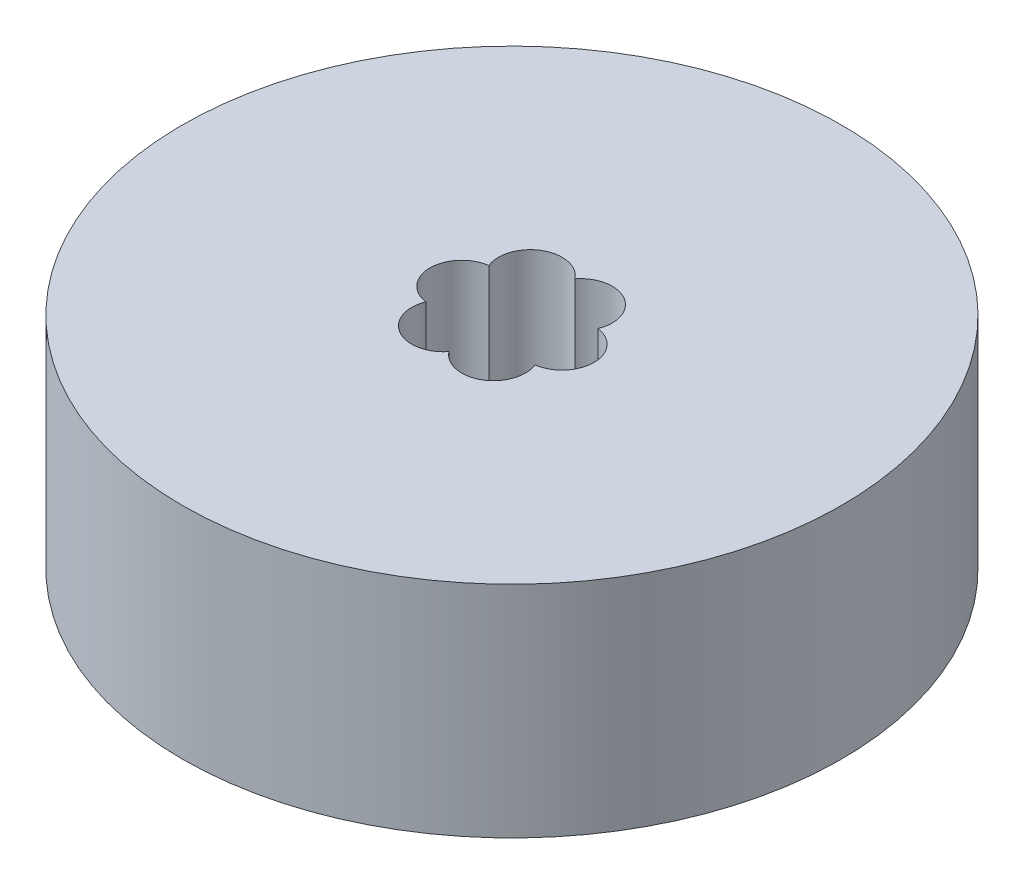
ISO-10303-21;
HEADER;
FILE_DESCRIPTION(('STEP AP214'),'2;1');
FILE_NAME('part.step','',(''),(''),'','','');
FILE_SCHEMA(('AUTOMOTIVE_DESIGN { 1 0 10303 214 1 1 1 1 }'));
ENDSEC;
DATA;
#1=APPLICATION_CONTEXT('core data for automotive mechanical design processes');
#2=APPLICATION_PROTOCOL_DEFINITION('international standard','automotive_design',2000,#1);
#3=PRODUCT_CONTEXT('',#1,'mechanical');
#4=PRODUCT('Part','Part','',(#3));
#5=PRODUCT_RELATED_PRODUCT_CATEGORY('part','',(#4));
#6=PRODUCT_DEFINITION_FORMATION('','',#4);
#7=PRODUCT_DEFINITION_CONTEXT('part definition',#1,'design');
#8=PRODUCT_DEFINITION('design','',#6,#7);
#9=PRODUCT_DEFINITION_SHAPE('','',#8);
#10=(LENGTH_UNIT() NAMED_UNIT(*) SI_UNIT(.MILLI.,.METRE.));
#11=(NAMED_UNIT(*) PLANE_ANGLE_UNIT() SI_UNIT($,.RADIAN.));
#12=(NAMED_UNIT(*) SI_UNIT($,.STERADIAN.) SOLID_ANGLE_UNIT());
#13=UNCERTAINTY_MEASURE_WITH_UNIT(LENGTH_MEASURE(1.E-05),#10,'distance_accuracy_value','');
#14=(GEOMETRIC_REPRESENTATION_CONTEXT(3) GLOBAL_UNCERTAINTY_ASSIGNED_CONTEXT((#13)) GLOBAL_UNIT_ASSIGNED_CONTEXT((#10,
#11,#12)) REPRESENTATION_CONTEXT('',''));
#15=CARTESIAN_POINT('',(0.,0.,0.));
#16=DIRECTION('',(0.,0.,1.));
#17=DIRECTION('',(1.,0.,0.));
#18=AXIS2_PLACEMENT_3D('',#15,#16,#17);
#19=CARTESIAN_POINT('',(0.,20.,0.));
#20=DIRECTION('',(0.,-1.,0.));
#21=DIRECTION('',(0.,0.,-1.));
#22=AXIS2_PLACEMENT_3D('',#19,#20,#21);
#23=CYLINDRICAL_SURFACE('',#22,5.);
#24=CARTESIAN_POINT('',(0.,0.,0.));
#25=DIRECTION('',(0.,1.,0.));
#26=DIRECTION('',(0.,0.,1.));
#27=AXIS2_PLACEMENT_3D('',#24,#25,#26);
#28=CIRCLE('',#27,5.);
#29=CARTESIAN_POINT('',(0.,0.,5.));
#30=VERTEX_POINT('',#29);
#31=EDGE_CURVE('E142',#30,#30,#28,.T.);
#32=ORIENTED_EDGE('',*,*,#31,.F.);
#33=EDGE_LOOP('',(#32));
#34=FACE_BOUND('',#33,.T.);
#35=CARTESIAN_POINT('',(0.,6.06249999064027,0.));
#36=DIRECTION('',(0.,1.,0.));
#37=DIRECTION('',(0.,0.,1.));
#38=AXIS2_PLACEMENT_3D('',#35,#36,#37);
#39=CIRCLE('',#38,5.);
#40=CARTESIAN_POINT('',(0.,6.06249999064027,5.));
#41=VERTEX_POINT('',#40);
#42=EDGE_CURVE('E11',#41,#41,#39,.T.);
#43=ORIENTED_EDGE('',*,*,#42,.T.);
#44=EDGE_LOOP('',(#43));
#45=FACE_BOUND('',#44,.T.);
#46=ADVANCED_FACE('F39',(#34,#45),#23,.F.);
#47=CARTESIAN_POINT('',(0.,20.,0.));
#48=DIRECTION('',(0.,-1.,0.));
#49=DIRECTION('',(0.,0.,-1.));
#50=AXIS2_PLACEMENT_3D('',#47,#48,#49);
#51=CYLINDRICAL_SURFACE('',#50,30.);
#52=CARTESIAN_POINT('',(0.,20.,0.));
#53=DIRECTION('',(0.,1.,0.));
#54=DIRECTION('',(0.,0.,1.));
#55=AXIS2_PLACEMENT_3D('',#52,#53,#54);
#56=CIRCLE('',#55,30.);
#57=CARTESIAN_POINT('',(0.,20.,30.));
#58=VERTEX_POINT('',#57);
#59=EDGE_CURVE('E50',#58,#58,#56,.T.);
#60=ORIENTED_EDGE('',*,*,#59,.F.);
#61=EDGE_LOOP('',(#60));
#62=FACE_BOUND('',#61,.T.);
#63=CARTESIAN_POINT('',(0.,0.,0.));
#64=DIRECTION('',(0.,1.,0.));
#65=DIRECTION('',(0.,0.,1.));
#66=AXIS2_PLACEMENT_3D('',#63,#64,#65);
#67=CIRCLE('',#66,30.);
#68=CARTESIAN_POINT('',(0.,0.,30.));
#69=VERTEX_POINT('',#68);
#70=EDGE_CURVE('E150',#69,#69,#67,.T.);
#71=ORIENTED_EDGE('',*,*,#70,.T.);
#72=EDGE_LOOP('',(#71));
#73=FACE_BOUND('',#72,.T.);
#74=ADVANCED_FACE('F41',(#62,#73),#51,.T.);
#75=CARTESIAN_POINT('',(0.,20.,0.));
#76=DIRECTION('',(0.,1.,0.));
#77=DIRECTION('',(0.,0.,1.));
#78=AXIS2_PLACEMENT_3D('',#75,#76,#77);
#79=PLANE('',#78);
#80=CARTESIAN_POINT('',(-2.28219094085619,20.,3.95287066213636));
#81=DIRECTION('',(0.,1.,0.));
#82=DIRECTION('',(0.86602540378444,0.,0.499999999999998));
#83=AXIS2_PLACEMENT_3D('',#80,#81,#82);
#84=CIRCLE('',#83,2.89860364299837);
#85=CARTESIAN_POINT('',(-4.97090738927212,20.,2.86995471931296));
#86=VERTEX_POINT('',#85);
#87=CARTESIAN_POINT('',(0.,20.,5.73990943862592));
#88=VERTEX_POINT('',#87);
#89=EDGE_CURVE('E132',#86,#88,#84,.T.);
#90=ORIENTED_EDGE('',*,*,#89,.F.);
#91=CARTESIAN_POINT('',(-4.5643818817124,20.,0.));
#92=DIRECTION('',(0.,1.,0.));
#93=DIRECTION('',(0.,0.,1.));
#94=AXIS2_PLACEMENT_3D('',#91,#92,#93);
#95=CIRCLE('',#94,2.89860364299837);
#96=CARTESIAN_POINT('',(-4.97090738927218,20.,-2.86995471931296));
#97=VERTEX_POINT('',#96);
#98=EDGE_CURVE('E138',#97,#86,#95,.T.);
#99=ORIENTED_EDGE('',*,*,#98,.F.);
#100=CARTESIAN_POINT('',(-2.28219094085625,20.,-3.95287066213633));
#101=DIRECTION('',(0.,1.,0.));
#102=DIRECTION('',(-0.866025403784433,0.,0.50000000000001));
#103=AXIS2_PLACEMENT_3D('',#100,#101,#102);
#104=CIRCLE('',#103,2.89860364299837);
#105=CARTESIAN_POINT('',(0.,20.,-5.73990943862592));
#106=VERTEX_POINT('',#105);
#107=EDGE_CURVE('E53',#106,#97,#104,.T.);
#108=ORIENTED_EDGE('',*,*,#107,.F.);
#109=CARTESIAN_POINT('',(2.28219094085616,20.,-3.95287066213638));
#110=DIRECTION('',(0.,1.,0.));
#111=DIRECTION('',(-0.866025403784443,0.,-0.499999999999992));
#112=AXIS2_PLACEMENT_3D('',#109,#110,#111);
#113=CIRCLE('',#112,2.89860364299837);
#114=CARTESIAN_POINT('',(4.97090738927209,20.,-2.86995471931297));
#115=VERTEX_POINT('',#114);
#116=EDGE_CURVE('E106',#115,#106,#113,.T.);
#117=ORIENTED_EDGE('',*,*,#116,.F.);
#118=CARTESIAN_POINT('',(4.5643818817124,20.,0.));
#119=DIRECTION('',(0.,1.,0.));
#120=DIRECTION('',(0.,0.,-1.));
#121=AXIS2_PLACEMENT_3D('',#118,#119,#120);
#122=CIRCLE('',#121,2.89860364299837);
#123=CARTESIAN_POINT('',(4.97090738927215,20.,2.86995471931296));
#124=VERTEX_POINT('',#123);
#125=EDGE_CURVE('E104',#124,#115,#122,.T.);
#126=ORIENTED_EDGE('',*,*,#125,.F.);
#127=CARTESIAN_POINT('',(2.28219094085622,20.,3.95287066213635));
#128=DIRECTION('',(0.,1.,0.));
#129=DIRECTION('',(0.866025403784436,0.,-0.500000000000004));
#130=AXIS2_PLACEMENT_3D('',#127,#128,#129);
#131=CIRCLE('',#130,2.89860364299837);
#132=EDGE_CURVE('E123',#88,#124,#131,.T.);
#133=ORIENTED_EDGE('',*,*,#132,.F.);
#134=EDGE_LOOP('',(#90,#99,#108,#117,#126,#133));
#135=FACE_BOUND('',#134,.T.);
#136=ORIENTED_EDGE('',*,*,#59,.T.);
#137=EDGE_LOOP('',(#136));
#138=FACE_BOUND('',#137,.T.);
#139=ADVANCED_FACE('F156',(#135,#138),#79,.T.);
#140=CARTESIAN_POINT('',(0.,0.,0.));
#141=DIRECTION('',(0.,1.,0.));
#142=DIRECTION('',(0.,0.,1.));
#143=AXIS2_PLACEMENT_3D('',#140,#141,#142);
#144=PLANE('',#143);
#145=ORIENTED_EDGE('',*,*,#31,.T.);
#146=EDGE_LOOP('',(#145));
#147=FACE_BOUND('',#146,.T.);
#148=ORIENTED_EDGE('',*,*,#70,.F.);
#149=EDGE_LOOP('',(#148));
#150=FACE_BOUND('',#149,.T.);
#151=ADVANCED_FACE('F153',(#147,#150),#144,.F.);
#152=CARTESIAN_POINT('',(-4.5643818817124,6.06249999064027,0.));
#153=DIRECTION('',(0.,1.,0.));
#154=DIRECTION('',(0.,0.,1.));
#155=AXIS2_PLACEMENT_3D('',#152,#153,#154);
#156=CYLINDRICAL_SURFACE('',#155,2.89860364299837);
#157=ORIENTED_EDGE('',*,*,#98,.T.);
#158=DIRECTION('',(0.,1.,0.));
#159=VECTOR('',#158,1.);
#160=CARTESIAN_POINT('',(-4.97090738927212,13.0312499953201,2.86995471931296));
#161=LINE('',#160,#159);
#162=CARTESIAN_POINT('',(-4.97090738927212,6.06249999064027,2.86995471931296));
#163=VERTEX_POINT('',#162);
#164=EDGE_CURVE('E65',#86,#163,#161,.F.);
#165=ORIENTED_EDGE('',*,*,#164,.T.);
#166=CARTESIAN_POINT('',(-4.5643818817124,6.06249999064027,0.));
#167=DIRECTION('',(0.,1.,0.));
#168=DIRECTION('',(0.,0.,1.));
#169=AXIS2_PLACEMENT_3D('',#166,#167,#168);
#170=CIRCLE('',#169,2.89860364299837);
#171=CARTESIAN_POINT('',(-4.97090738927218,6.06249999064027,-2.86995471931295));
#172=VERTEX_POINT('',#171);
#173=EDGE_CURVE('E139',#172,#163,#170,.T.);
#174=ORIENTED_EDGE('',*,*,#173,.F.);
#175=DIRECTION('',(0.,1.,0.));
#176=VECTOR('',#175,1.);
#177=CARTESIAN_POINT('',(-4.97090738927218,13.0312499953201,-2.86995471931295));
#178=LINE('',#177,#176);
#179=EDGE_CURVE('E114',#172,#97,#178,.T.);
#180=ORIENTED_EDGE('',*,*,#179,.T.);
#181=EDGE_LOOP('',(#157,#165,#174,#180));
#182=FACE_BOUND('',#181,.T.);
#183=ADVANCED_FACE('F154',(#182),#156,.F.);
#184=CARTESIAN_POINT('',(-4.5643818817124,6.06249999064027,0.));
#185=DIRECTION('',(0.,1.,0.));
#186=DIRECTION('',(0.,0.,1.));
#187=AXIS2_PLACEMENT_3D('',#184,#185,#186);
#188=PLANE('',#187);
#189=CARTESIAN_POINT('',(-2.28219094085625,6.06249999064027,-3.95287066213633));
#190=DIRECTION('',(0.,1.,0.));
#191=DIRECTION('',(-0.866025403784433,0.,0.50000000000001));
#192=AXIS2_PLACEMENT_3D('',#189,#190,#191);
#193=CIRCLE('',#192,2.89860364299837);
#194=CARTESIAN_POINT('',(0.,6.06249999064027,-5.73990943862592));
#195=VERTEX_POINT('',#194);
#196=EDGE_CURVE('E97',#195,#172,#193,.T.);
#197=ORIENTED_EDGE('',*,*,#196,.T.);
#198=ORIENTED_EDGE('',*,*,#173,.T.);
#199=CARTESIAN_POINT('',(-2.28219094085619,6.06249999064027,3.95287066213636));
#200=DIRECTION('',(0.,1.,0.));
#201=DIRECTION('',(0.86602540378444,0.,0.499999999999998));
#202=AXIS2_PLACEMENT_3D('',#199,#200,#201);
#203=CIRCLE('',#202,2.89860364299837);
#204=CARTESIAN_POINT('',(0.,6.06249999064027,5.73990943862592));
#205=VERTEX_POINT('',#204);
#206=EDGE_CURVE('E133',#163,#205,#203,.T.);
#207=ORIENTED_EDGE('',*,*,#206,.T.);
#208=CARTESIAN_POINT('',(2.28219094085622,6.06249999064027,3.95287066213635));
#209=DIRECTION('',(0.,1.,0.));
#210=DIRECTION('',(0.866025403784436,0.,-0.500000000000004));
#211=AXIS2_PLACEMENT_3D('',#208,#209,#210);
#212=CIRCLE('',#211,2.89860364299837);
#213=CARTESIAN_POINT('',(4.97090738927215,6.06249999064027,2.86995471931296));
#214=VERTEX_POINT('',#213);
#215=EDGE_CURVE('E124',#205,#214,#212,.T.);
#216=ORIENTED_EDGE('',*,*,#215,.T.);
#217=CARTESIAN_POINT('',(4.5643818817124,6.06249999064027,0.));
#218=DIRECTION('',(0.,1.,0.));
#219=DIRECTION('',(0.,0.,-1.));
#220=AXIS2_PLACEMENT_3D('',#217,#218,#219);
#221=CIRCLE('',#220,2.89860364299837);
#222=CARTESIAN_POINT('',(4.97090738927209,6.06249999064027,-2.86995471931297));
#223=VERTEX_POINT('',#222);
#224=EDGE_CURVE('E105',#214,#223,#221,.T.);
#225=ORIENTED_EDGE('',*,*,#224,.T.);
#226=CARTESIAN_POINT('',(2.28219094085616,6.06249999064027,-3.95287066213638));
#227=DIRECTION('',(0.,1.,0.));
#228=DIRECTION('',(-0.866025403784443,0.,-0.499999999999992));
#229=AXIS2_PLACEMENT_3D('',#226,#227,#228);
#230=CIRCLE('',#229,2.89860364299837);
#231=EDGE_CURVE('E91',#223,#195,#230,.T.);
#232=ORIENTED_EDGE('',*,*,#231,.T.);
#233=EDGE_LOOP('',(#197,#198,#207,#216,#225,#232));
#234=FACE_BOUND('',#233,.T.);
#235=ORIENTED_EDGE('',*,*,#42,.F.);
#236=EDGE_LOOP('',(#235));
#237=FACE_BOUND('',#236,.T.);
#238=ADVANCED_FACE('F92',(#234,#237),#188,.T.);
#239=CARTESIAN_POINT('',(-2.28219094085619,6.06249999064027,3.95287066213636));
#240=DIRECTION('',(0.,1.,0.));
#241=DIRECTION('',(0.,0.,1.));
#242=AXIS2_PLACEMENT_3D('',#239,#240,#241);
#243=CYLINDRICAL_SURFACE('',#242,2.89860364299837);
#244=ORIENTED_EDGE('',*,*,#89,.T.);
#245=DIRECTION('',(0.,1.,0.));
#246=VECTOR('',#245,1.);
#247=CARTESIAN_POINT('',(0.,13.0312499953201,5.73990943862592));
#248=LINE('',#247,#246);
#249=EDGE_CURVE('E128',#88,#205,#248,.F.);
#250=ORIENTED_EDGE('',*,*,#249,.T.);
#251=ORIENTED_EDGE('',*,*,#206,.F.);
#252=ORIENTED_EDGE('',*,*,#164,.F.);
#253=EDGE_LOOP('',(#244,#250,#251,#252));
#254=FACE_BOUND('',#253,.T.);
#255=ADVANCED_FACE('F177',(#254),#243,.F.);
#256=CARTESIAN_POINT('',(-2.28219094085625,6.06249999064027,-3.95287066213633));
#257=DIRECTION('',(0.,1.,0.));
#258=DIRECTION('',(0.,0.,1.));
#259=AXIS2_PLACEMENT_3D('',#256,#257,#258);
#260=CYLINDRICAL_SURFACE('',#259,2.89860364299837);
#261=ORIENTED_EDGE('',*,*,#196,.F.);
#262=DIRECTION('',(0.,1.,0.));
#263=VECTOR('',#262,1.);
#264=CARTESIAN_POINT('',(0.,13.0312499953201,-5.73990943862592));
#265=LINE('',#264,#263);
#266=EDGE_CURVE('E107',#106,#195,#265,.F.);
#267=ORIENTED_EDGE('',*,*,#266,.F.);
#268=ORIENTED_EDGE('',*,*,#107,.T.);
#269=ORIENTED_EDGE('',*,*,#179,.F.);
#270=EDGE_LOOP('',(#261,#267,#268,#269));
#271=FACE_BOUND('',#270,.T.);
#272=ADVANCED_FACE('F115',(#271),#260,.F.);
#273=CARTESIAN_POINT('',(2.28219094085622,6.06249999064027,3.95287066213635));
#274=DIRECTION('',(0.,1.,0.));
#275=DIRECTION('',(0.,0.,1.));
#276=AXIS2_PLACEMENT_3D('',#273,#274,#275);
#277=CYLINDRICAL_SURFACE('',#276,2.89860364299837);
#278=ORIENTED_EDGE('',*,*,#132,.T.);
#279=DIRECTION('',(0.,1.,0.));
#280=VECTOR('',#279,1.);
#281=CARTESIAN_POINT('',(4.97090738927215,13.0312499953201,2.86995471931296));
#282=LINE('',#281,#280);
#283=EDGE_CURVE('E118',#124,#214,#282,.F.);
#284=ORIENTED_EDGE('',*,*,#283,.T.);
#285=ORIENTED_EDGE('',*,*,#215,.F.);
#286=ORIENTED_EDGE('',*,*,#249,.F.);
#287=EDGE_LOOP('',(#278,#284,#285,#286));
#288=FACE_BOUND('',#287,.T.);
#289=ADVANCED_FACE('F182',(#288),#277,.F.);
#290=CARTESIAN_POINT('',(4.5643818817124,6.06249999064027,0.));
#291=DIRECTION('',(0.,1.,0.));
#292=DIRECTION('',(0.,0.,1.));
#293=AXIS2_PLACEMENT_3D('',#290,#291,#292);
#294=CYLINDRICAL_SURFACE('',#293,2.89860364299837);
#295=DIRECTION('',(0.,1.,0.));
#296=VECTOR('',#295,1.);
#297=CARTESIAN_POINT('',(4.97090738927209,13.0312499953201,-2.86995471931297));
#298=LINE('',#297,#296);
#299=EDGE_CURVE('E130',#115,#223,#298,.F.);
#300=ORIENTED_EDGE('',*,*,#299,.T.);
#301=ORIENTED_EDGE('',*,*,#224,.F.);
#302=ORIENTED_EDGE('',*,*,#283,.F.);
#303=ORIENTED_EDGE('',*,*,#125,.T.);
#304=EDGE_LOOP('',(#300,#301,#302,#303));
#305=FACE_BOUND('',#304,.T.);
#306=ADVANCED_FACE('F184',(#305),#294,.F.);
#307=CARTESIAN_POINT('',(2.28219094085616,6.06249999064027,-3.95287066213638));
#308=DIRECTION('',(0.,1.,0.));
#309=DIRECTION('',(0.,0.,1.));
#310=AXIS2_PLACEMENT_3D('',#307,#308,#309);
#311=CYLINDRICAL_SURFACE('',#310,2.89860364299837);
#312=ORIENTED_EDGE('',*,*,#116,.T.);
#313=ORIENTED_EDGE('',*,*,#266,.T.);
#314=ORIENTED_EDGE('',*,*,#231,.F.);
#315=ORIENTED_EDGE('',*,*,#299,.F.);
#316=EDGE_LOOP('',(#312,#313,#314,#315));
#317=FACE_BOUND('',#316,.T.);
#318=ADVANCED_FACE('F108',(#317),#311,.F.);
#319=CLOSED_SHELL('',(#46,#74,#139,#151,#183,#238,#255,#272,#289,#306,#318));
#320=MANIFOLD_SOLID_BREP('B2',#319);
#321=ADVANCED_BREP_SHAPE_REPRESENTATION('',(#18,#320),#14);
#322=SHAPE_DEFINITION_REPRESENTATION(#9,#321);
ENDSEC;
END-ISO-10303-21;
